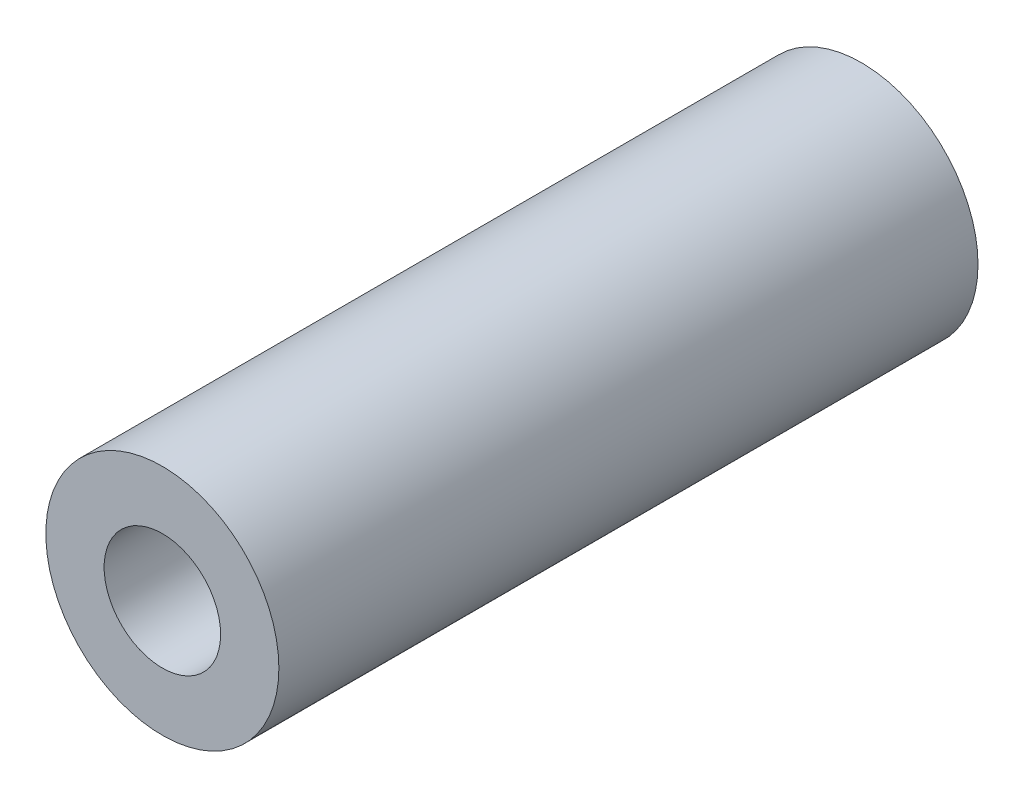
ISO-10303-21;
HEADER;
FILE_DESCRIPTION(('STEP AP214'),'2;1');
FILE_NAME('part.step','',(''),(''),'','','');
FILE_SCHEMA(('AUTOMOTIVE_DESIGN { 1 0 10303 214 1 1 1 1 }'));
ENDSEC;
DATA;
#1=APPLICATION_CONTEXT('core data for automotive mechanical design processes');
#2=APPLICATION_PROTOCOL_DEFINITION('international standard','automotive_design',2000,#1);
#3=PRODUCT_CONTEXT('',#1,'mechanical');
#4=PRODUCT('Part','Part','',(#3));
#5=PRODUCT_RELATED_PRODUCT_CATEGORY('part','',(#4));
#6=PRODUCT_DEFINITION_FORMATION('','',#4);
#7=PRODUCT_DEFINITION_CONTEXT('part definition',#1,'design');
#8=PRODUCT_DEFINITION('design','',#6,#7);
#9=PRODUCT_DEFINITION_SHAPE('','',#8);
#10=(LENGTH_UNIT() NAMED_UNIT(*) SI_UNIT(.MILLI.,.METRE.));
#11=(NAMED_UNIT(*) PLANE_ANGLE_UNIT() SI_UNIT($,.RADIAN.));
#12=(NAMED_UNIT(*) SI_UNIT($,.STERADIAN.) SOLID_ANGLE_UNIT());
#13=UNCERTAINTY_MEASURE_WITH_UNIT(LENGTH_MEASURE(1.E-05),#10,'distance_accuracy_value','');
#14=(GEOMETRIC_REPRESENTATION_CONTEXT(3) GLOBAL_UNCERTAINTY_ASSIGNED_CONTEXT((#13)) GLOBAL_UNIT_ASSIGNED_CONTEXT((#10,
#11,#12)) REPRESENTATION_CONTEXT('',''));
#15=CARTESIAN_POINT('',(0.,0.,0.));
#16=DIRECTION('',(0.,0.,1.));
#17=DIRECTION('',(1.,0.,0.));
#18=AXIS2_PLACEMENT_3D('',#15,#16,#17);
#19=CARTESIAN_POINT('',(0.,0.,120.));
#20=DIRECTION('',(0.,0.,1.));
#21=DIRECTION('',(1.,0.,0.));
#22=AXIS2_PLACEMENT_3D('',#19,#20,#21);
#23=PLANE('',#22);
#24=CARTESIAN_POINT('',(0.,0.,120.));
#25=DIRECTION('',(0.,0.,1.));
#26=DIRECTION('',(1.,0.,0.));
#27=AXIS2_PLACEMENT_3D('',#24,#25,#26);
#28=CIRCLE('',#27,20.);
#29=CARTESIAN_POINT('',(20.,0.,120.));
#30=VERTEX_POINT('',#29);
#31=EDGE_CURVE('E10',#30,#30,#28,.T.);
#32=ORIENTED_EDGE('',*,*,#31,.T.);
#33=EDGE_LOOP('',(#32));
#34=FACE_BOUND('',#33,.T.);
#35=CARTESIAN_POINT('',(0.,0.,120.));
#36=DIRECTION('',(0.,0.,1.));
#37=DIRECTION('',(1.,0.,0.));
#38=AXIS2_PLACEMENT_3D('',#35,#36,#37);
#39=CIRCLE('',#38,10.);
#40=CARTESIAN_POINT('',(10.,0.,120.));
#41=VERTEX_POINT('',#40);
#42=EDGE_CURVE('E43',#41,#41,#39,.T.);
#43=ORIENTED_EDGE('',*,*,#42,.F.);
#44=EDGE_LOOP('',(#43));
#45=FACE_BOUND('',#44,.T.);
#46=ADVANCED_FACE('F32',(#34,#45),#23,.T.);
#47=CARTESIAN_POINT('',(0.,0.,0.));
#48=DIRECTION('',(0.,0.,1.));
#49=DIRECTION('',(1.,0.,0.));
#50=AXIS2_PLACEMENT_3D('',#47,#48,#49);
#51=PLANE('',#50);
#52=CARTESIAN_POINT('',(0.,0.,0.));
#53=DIRECTION('',(0.,0.,1.));
#54=DIRECTION('',(1.,0.,0.));
#55=AXIS2_PLACEMENT_3D('',#52,#53,#54);
#56=CIRCLE('',#55,20.);
#57=CARTESIAN_POINT('',(20.,0.,0.));
#58=VERTEX_POINT('',#57);
#59=EDGE_CURVE('E36',#58,#58,#56,.T.);
#60=ORIENTED_EDGE('',*,*,#59,.F.);
#61=EDGE_LOOP('',(#60));
#62=FACE_BOUND('',#61,.T.);
#63=CARTESIAN_POINT('',(0.,0.,0.));
#64=DIRECTION('',(0.,0.,1.));
#65=DIRECTION('',(1.,0.,0.));
#66=AXIS2_PLACEMENT_3D('',#63,#64,#65);
#67=CIRCLE('',#66,10.);
#68=CARTESIAN_POINT('',(10.,0.,0.));
#69=VERTEX_POINT('',#68);
#70=EDGE_CURVE('E45',#69,#69,#67,.T.);
#71=ORIENTED_EDGE('',*,*,#70,.T.);
#72=EDGE_LOOP('',(#71));
#73=FACE_BOUND('',#72,.T.);
#74=ADVANCED_FACE('F55',(#62,#73),#51,.F.);
#75=CARTESIAN_POINT('',(0.,0.,120.));
#76=DIRECTION('',(0.,0.,-1.));
#77=DIRECTION('',(-1.,0.,0.));
#78=AXIS2_PLACEMENT_3D('',#75,#76,#77);
#79=CYLINDRICAL_SURFACE('',#78,20.);
#80=ORIENTED_EDGE('',*,*,#31,.F.);
#81=EDGE_LOOP('',(#80));
#82=FACE_BOUND('',#81,.T.);
#83=ORIENTED_EDGE('',*,*,#59,.T.);
#84=EDGE_LOOP('',(#83));
#85=FACE_BOUND('',#84,.T.);
#86=ADVANCED_FACE('F34',(#82,#85),#79,.T.);
#87=CARTESIAN_POINT('',(0.,0.,120.));
#88=DIRECTION('',(0.,0.,-1.));
#89=DIRECTION('',(-1.,0.,0.));
#90=AXIS2_PLACEMENT_3D('',#87,#88,#89);
#91=CYLINDRICAL_SURFACE('',#90,10.);
#92=ORIENTED_EDGE('',*,*,#42,.T.);
#93=EDGE_LOOP('',(#92));
#94=FACE_BOUND('',#93,.T.);
#95=ORIENTED_EDGE('',*,*,#70,.F.);
#96=EDGE_LOOP('',(#95));
#97=FACE_BOUND('',#96,.T.);
#98=ADVANCED_FACE('F51',(#94,#97),#91,.F.);
#99=CLOSED_SHELL('',(#46,#74,#86,#98));
#100=MANIFOLD_SOLID_BREP('B2',#99);
#101=ADVANCED_BREP_SHAPE_REPRESENTATION('',(#18,#100),#14);
#102=SHAPE_DEFINITION_REPRESENTATION(#9,#101);
ENDSEC;
END-ISO-10303-21;
